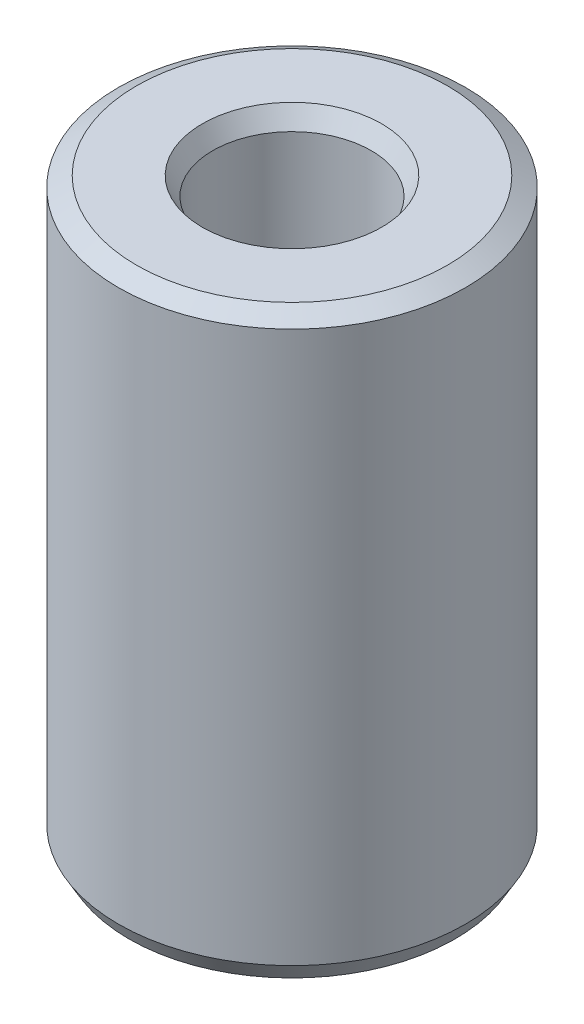
ISO-10303-21;
HEADER;
FILE_DESCRIPTION(('STEP AP214'),'2;1');
FILE_NAME('part.step','',(''),(''),'','','');
FILE_SCHEMA(('AUTOMOTIVE_DESIGN { 1 0 10303 214 1 1 1 1 }'));
ENDSEC;
DATA;
#1=APPLICATION_CONTEXT('core data for automotive mechanical design processes');
#2=APPLICATION_PROTOCOL_DEFINITION('international standard','automotive_design',2000,#1);
#3=PRODUCT_CONTEXT('',#1,'mechanical');
#4=PRODUCT('Part','Part','',(#3));
#5=PRODUCT_RELATED_PRODUCT_CATEGORY('part','',(#4));
#6=PRODUCT_DEFINITION_FORMATION('','',#4);
#7=PRODUCT_DEFINITION_CONTEXT('part definition',#1,'design');
#8=PRODUCT_DEFINITION('design','',#6,#7);
#9=PRODUCT_DEFINITION_SHAPE('','',#8);
#10=(LENGTH_UNIT() NAMED_UNIT(*) SI_UNIT(.MILLI.,.METRE.));
#11=(NAMED_UNIT(*) PLANE_ANGLE_UNIT() SI_UNIT($,.RADIAN.));
#12=(NAMED_UNIT(*) SI_UNIT($,.STERADIAN.) SOLID_ANGLE_UNIT());
#13=UNCERTAINTY_MEASURE_WITH_UNIT(LENGTH_MEASURE(1.E-05),#10,'distance_accuracy_value','');
#14=(GEOMETRIC_REPRESENTATION_CONTEXT(3) GLOBAL_UNCERTAINTY_ASSIGNED_CONTEXT((#13)) GLOBAL_UNIT_ASSIGNED_CONTEXT((#10,
#11,#12)) REPRESENTATION_CONTEXT('',''));
#15=CARTESIAN_POINT('',(0.,0.,0.));
#16=DIRECTION('',(0.,0.,1.));
#17=DIRECTION('',(1.,0.,0.));
#18=AXIS2_PLACEMENT_3D('',#15,#16,#17);
#19=CARTESIAN_POINT('',(0.,133.650748897422,0.));
#20=DIRECTION('',(0.,-1.,0.));
#21=DIRECTION('',(0.,0.,-1.));
#22=AXIS2_PLACEMENT_3D('',#19,#20,#21);
#23=CYLINDRICAL_SURFACE('',#22,40.);
#24=CARTESIAN_POINT('',(0.,4.16025401112199,0.));
#25=DIRECTION('',(0.,1.,0.));
#26=DIRECTION('',(0.,0.,1.));
#27=AXIS2_PLACEMENT_3D('',#24,#25,#26);
#28=CIRCLE('',#27,40.);
#29=CARTESIAN_POINT('',(0.,4.16025401112199,40.));
#30=VERTEX_POINT('',#29);
#31=EDGE_CURVE('E10',#30,#30,#28,.T.);
#32=ORIENTED_EDGE('',*,*,#31,.T.);
#33=EDGE_LOOP('',(#32));
#34=FACE_BOUND('',#33,.T.);
#35=CARTESIAN_POINT('',(0.,131.248825124204,0.));
#36=DIRECTION('',(0.,1.,0.));
#37=DIRECTION('',(0.,0.,1.));
#38=AXIS2_PLACEMENT_3D('',#35,#36,#37);
#39=CIRCLE('',#38,40.);
#40=CARTESIAN_POINT('',(0.,131.248825124204,40.));
#41=VERTEX_POINT('',#40);
#42=EDGE_CURVE('E50',#41,#41,#39,.F.);
#43=ORIENTED_EDGE('',*,*,#42,.T.);
#44=EDGE_LOOP('',(#43));
#45=FACE_BOUND('',#44,.T.);
#46=ADVANCED_FACE('F39',(#34,#45),#23,.T.);
#47=CARTESIAN_POINT('',(0.,133.650748897422,0.));
#48=DIRECTION('',(0.,1.,0.));
#49=DIRECTION('',(0.,0.,1.));
#50=AXIS2_PLACEMENT_3D('',#47,#48,#49);
#51=PLANE('',#50);
#52=CARTESIAN_POINT('',(0.,133.650748897422,0.));
#53=DIRECTION('',(0.,1.,0.));
#54=DIRECTION('',(0.,0.,1.));
#55=AXIS2_PLACEMENT_3D('',#52,#53,#54);
#56=CIRCLE('',#55,20.6806017135239);
#57=CARTESIAN_POINT('',(0.,133.650748897422,20.6806017135239));
#58=VERTEX_POINT('',#57);
#59=EDGE_CURVE('E58',#58,#58,#56,.F.);
#60=ORIENTED_EDGE('',*,*,#59,.T.);
#61=EDGE_LOOP('',(#60));
#62=FACE_BOUND('',#61,.T.);
#63=CARTESIAN_POINT('',(0.,133.650748897422,0.));
#64=DIRECTION('',(0.,1.,0.));
#65=DIRECTION('',(0.,0.,1.));
#66=AXIS2_PLACEMENT_3D('',#63,#64,#65);
#67=CIRCLE('',#66,35.839745988878);
#68=CARTESIAN_POINT('',(0.,133.650748897422,35.839745988878));
#69=VERTEX_POINT('',#68);
#70=EDGE_CURVE('E61',#69,#69,#67,.T.);
#71=ORIENTED_EDGE('',*,*,#70,.T.);
#72=EDGE_LOOP('',(#71));
#73=FACE_BOUND('',#72,.T.);
#74=ADVANCED_FACE('F88',(#62,#73),#51,.T.);
#75=CARTESIAN_POINT('',(0.,0.,0.));
#76=DIRECTION('',(0.,1.,0.));
#77=DIRECTION('',(0.,0.,1.));
#78=AXIS2_PLACEMENT_3D('',#75,#76,#77);
#79=PLANE('',#78);
#80=CARTESIAN_POINT('',(0.,0.,0.));
#81=DIRECTION('',(0.,1.,0.));
#82=DIRECTION('',(0.,0.,1.));
#83=AXIS2_PLACEMENT_3D('',#80,#81,#82);
#84=CIRCLE('',#83,22.4389319514274);
#85=CARTESIAN_POINT('',(0.,0.,22.4389319514274));
#86=VERTEX_POINT('',#85);
#87=EDGE_CURVE('E51',#86,#86,#84,.T.);
#88=ORIENTED_EDGE('',*,*,#87,.T.);
#89=EDGE_LOOP('',(#88));
#90=FACE_BOUND('',#89,.T.);
#91=CARTESIAN_POINT('',(0.,0.,0.));
#92=DIRECTION('',(0.,1.,0.));
#93=DIRECTION('',(0.,0.,1.));
#94=AXIS2_PLACEMENT_3D('',#91,#92,#93);
#95=CIRCLE('',#94,37.5980762267815);
#96=CARTESIAN_POINT('',(0.,0.,37.5980762267815));
#97=VERTEX_POINT('',#96);
#98=EDGE_CURVE('E54',#97,#97,#95,.F.);
#99=ORIENTED_EDGE('',*,*,#98,.T.);
#100=EDGE_LOOP('',(#99));
#101=FACE_BOUND('',#100,.T.);
#102=ADVANCED_FACE('F83',(#90,#101),#79,.F.);
#103=CARTESIAN_POINT('',(0.,133.650748897422,0.));
#104=DIRECTION('',(0.,-1.,0.));
#105=DIRECTION('',(0.,0.,-1.));
#106=AXIS2_PLACEMENT_3D('',#103,#104,#105);
#107=CYLINDRICAL_SURFACE('',#106,18.2786779403054);
#108=CARTESIAN_POINT('',(0.,129.4904948863,0.));
#109=DIRECTION('',(0.,1.,0.));
#110=DIRECTION('',(0.,0.,1.));
#111=AXIS2_PLACEMENT_3D('',#108,#109,#110);
#112=CIRCLE('',#111,18.2786779403054);
#113=CARTESIAN_POINT('',(0.,129.4904948863,18.2786779403054));
#114=VERTEX_POINT('',#113);
#115=EDGE_CURVE('E67',#114,#114,#112,.T.);
#116=ORIENTED_EDGE('',*,*,#115,.T.);
#117=EDGE_LOOP('',(#116));
#118=FACE_BOUND('',#117,.T.);
#119=CARTESIAN_POINT('',(0.,2.40192377321852,0.));
#120=DIRECTION('',(0.,1.,0.));
#121=DIRECTION('',(0.,0.,1.));
#122=AXIS2_PLACEMENT_3D('',#119,#120,#121);
#123=CIRCLE('',#122,18.2786779403054);
#124=CARTESIAN_POINT('',(0.,2.40192377321852,18.2786779403054));
#125=VERTEX_POINT('',#124);
#126=EDGE_CURVE('E69',#125,#125,#123,.F.);
#127=ORIENTED_EDGE('',*,*,#126,.T.);
#128=EDGE_LOOP('',(#127));
#129=FACE_BOUND('',#128,.T.);
#130=ADVANCED_FACE('F71',(#118,#129),#107,.F.);
#131=CARTESIAN_POINT('',(0.,129.4904948863,0.));
#132=DIRECTION('',(0.,1.,0.));
#133=DIRECTION('',(0.,0.,1.));
#134=AXIS2_PLACEMENT_3D('',#131,#132,#133);
#135=CONICAL_SURFACE('',#134,18.2786779403054,0.523598775598302);
#136=ORIENTED_EDGE('',*,*,#59,.F.);
#137=EDGE_LOOP('',(#136));
#138=FACE_BOUND('',#137,.T.);
#139=ORIENTED_EDGE('',*,*,#115,.F.);
#140=EDGE_LOOP('',(#139));
#141=FACE_BOUND('',#140,.T.);
#142=ADVANCED_FACE('F77',(#138,#141),#135,.F.);
#143=CARTESIAN_POINT('',(0.,0.,0.));
#144=DIRECTION('',(0.,-1.,0.));
#145=DIRECTION('',(0.,0.,-1.));
#146=AXIS2_PLACEMENT_3D('',#143,#144,#145);
#147=CONICAL_SURFACE('',#146,22.4389319514274,1.04719755119659);
#148=ORIENTED_EDGE('',*,*,#126,.F.);
#149=EDGE_LOOP('',(#148));
#150=FACE_BOUND('',#149,.T.);
#151=ORIENTED_EDGE('',*,*,#87,.F.);
#152=EDGE_LOOP('',(#151));
#153=FACE_BOUND('',#152,.T.);
#154=ADVANCED_FACE('F73',(#150,#153),#147,.F.);
#155=CARTESIAN_POINT('',(0.,4.16025401112199,0.));
#156=DIRECTION('',(0.,1.,0.));
#157=DIRECTION('',(0.,0.,1.));
#158=AXIS2_PLACEMENT_3D('',#155,#156,#157);
#159=CONICAL_SURFACE('',#158,40.,0.523598775598304);
#160=ORIENTED_EDGE('',*,*,#98,.F.);
#161=EDGE_LOOP('',(#160));
#162=FACE_BOUND('',#161,.T.);
#163=ORIENTED_EDGE('',*,*,#31,.F.);
#164=EDGE_LOOP('',(#163));
#165=FACE_BOUND('',#164,.T.);
#166=ADVANCED_FACE('F76',(#162,#165),#159,.T.);
#167=CARTESIAN_POINT('',(0.,133.650748897422,0.));
#168=DIRECTION('',(0.,-1.,0.));
#169=DIRECTION('',(0.,0.,-1.));
#170=AXIS2_PLACEMENT_3D('',#167,#168,#169);
#171=CONICAL_SURFACE('',#170,35.839745988878,1.0471975511966);
#172=ORIENTED_EDGE('',*,*,#42,.F.);
#173=EDGE_LOOP('',(#172));
#174=FACE_BOUND('',#173,.T.);
#175=ORIENTED_EDGE('',*,*,#70,.F.);
#176=EDGE_LOOP('',(#175));
#177=FACE_BOUND('',#176,.T.);
#178=ADVANCED_FACE('F45',(#174,#177),#171,.T.);
#179=CLOSED_SHELL('',(#46,#74,#102,#130,#142,#154,#166,#178));
#180=MANIFOLD_SOLID_BREP('B2',#179);
#181=ADVANCED_BREP_SHAPE_REPRESENTATION('',(#18,#180),#14);
#182=SHAPE_DEFINITION_REPRESENTATION(#9,#181);
ENDSEC;
END-ISO-10303-21;
